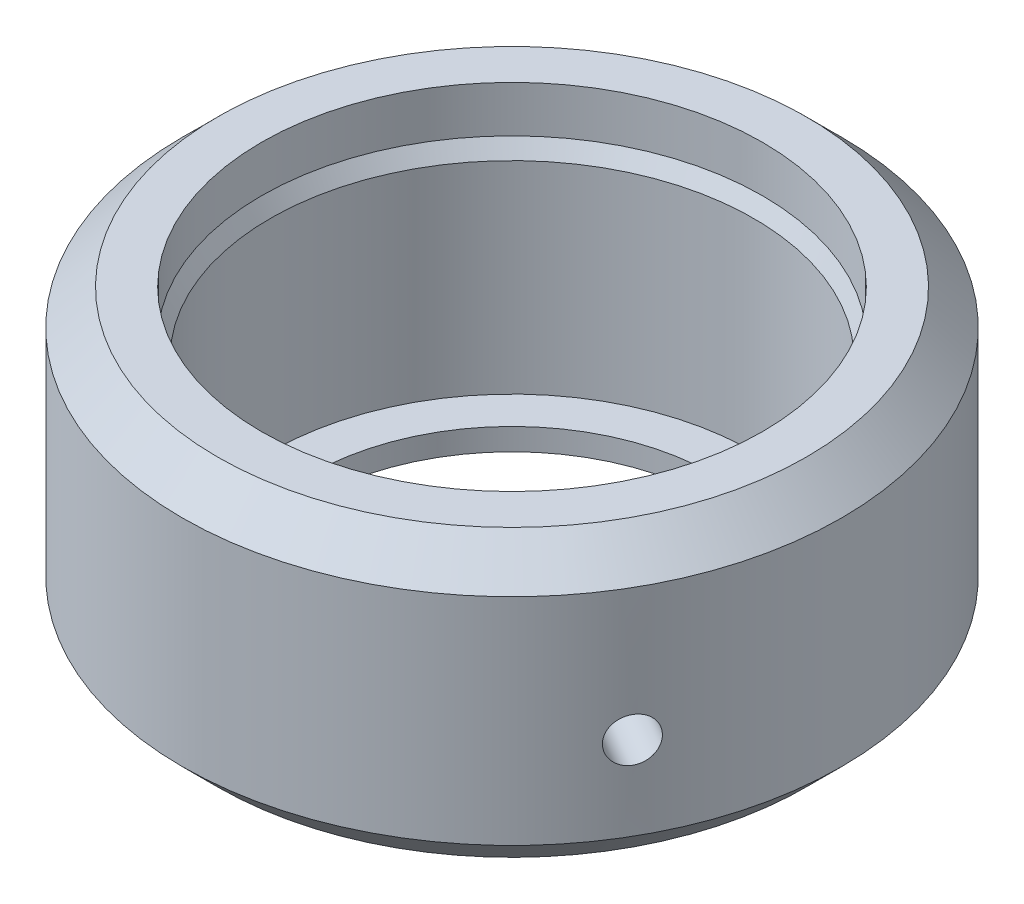
ISO-10303-21;
HEADER;
FILE_DESCRIPTION(('STEP AP214'),'2;1');
FILE_NAME('part.step','',(''),(''),'','','');
FILE_SCHEMA(('AUTOMOTIVE_DESIGN { 1 0 10303 214 1 1 1 1 }'));
ENDSEC;
DATA;
#1=APPLICATION_CONTEXT('core data for automotive mechanical design processes');
#2=APPLICATION_PROTOCOL_DEFINITION('international standard','automotive_design',2000,#1);
#3=PRODUCT_CONTEXT('',#1,'mechanical');
#4=PRODUCT('Part','Part','',(#3));
#5=PRODUCT_RELATED_PRODUCT_CATEGORY('part','',(#4));
#6=PRODUCT_DEFINITION_FORMATION('','',#4);
#7=PRODUCT_DEFINITION_CONTEXT('part definition',#1,'design');
#8=PRODUCT_DEFINITION('design','',#6,#7);
#9=PRODUCT_DEFINITION_SHAPE('','',#8);
#10=(LENGTH_UNIT() NAMED_UNIT(*) SI_UNIT(.MILLI.,.METRE.));
#11=(NAMED_UNIT(*) PLANE_ANGLE_UNIT() SI_UNIT($,.RADIAN.));
#12=(NAMED_UNIT(*) SI_UNIT($,.STERADIAN.) SOLID_ANGLE_UNIT());
#13=UNCERTAINTY_MEASURE_WITH_UNIT(LENGTH_MEASURE(1.E-05),#10,'distance_accuracy_value','');
#14=(GEOMETRIC_REPRESENTATION_CONTEXT(3) GLOBAL_UNCERTAINTY_ASSIGNED_CONTEXT((#13)) GLOBAL_UNIT_ASSIGNED_CONTEXT((#10,
#11,#12)) REPRESENTATION_CONTEXT('',''));
#15=CARTESIAN_POINT('',(0.,0.,0.));
#16=DIRECTION('',(0.,0.,1.));
#17=DIRECTION('',(1.,0.,0.));
#18=AXIS2_PLACEMENT_3D('',#15,#16,#17);
#19=CARTESIAN_POINT('',(0.,5.,0.));
#20=DIRECTION('',(0.,1.,0.));
#21=DIRECTION('',(0.,0.,1.));
#22=AXIS2_PLACEMENT_3D('',#19,#20,#21);
#23=PLANE('',#22);
#24=CARTESIAN_POINT('',(0.,5.,0.));
#25=DIRECTION('',(0.,1.,0.));
#26=DIRECTION('',(0.,0.,1.));
#27=AXIS2_PLACEMENT_3D('',#24,#25,#26);
#28=CIRCLE('',#27,46.);
#29=CARTESIAN_POINT('',(0.,5.,46.));
#30=VERTEX_POINT('',#29);
#31=EDGE_CURVE('E17',#30,#30,#28,.F.);
#32=ORIENTED_EDGE('',*,*,#31,.T.);
#33=EDGE_LOOP('',(#32));
#34=FACE_BOUND('',#33,.T.);
#35=CARTESIAN_POINT('',(0.,5.,0.));
#36=DIRECTION('',(0.,1.,0.));
#37=DIRECTION('',(0.,0.,1.));
#38=AXIS2_PLACEMENT_3D('',#35,#36,#37);
#39=CIRCLE('',#38,55.);
#40=CARTESIAN_POINT('',(0.,5.,55.));
#41=VERTEX_POINT('',#40);
#42=EDGE_CURVE('E115',#41,#41,#39,.T.);
#43=ORIENTED_EDGE('',*,*,#42,.T.);
#44=EDGE_LOOP('',(#43));
#45=FACE_BOUND('',#44,.T.);
#46=ADVANCED_FACE('F14',(#34,#45),#23,.T.);
#47=CARTESIAN_POINT('',(0.,54.4641016151031,0.));
#48=DIRECTION('',(0.,1.,0.));
#49=DIRECTION('',(0.,0.,1.));
#50=AXIS2_PLACEMENT_3D('',#47,#48,#49);
#51=CONICAL_SURFACE('',#50,56.9999999999946,0.523598775598);
#52=CARTESIAN_POINT('',(0.,51.,0.));
#53=DIRECTION('',(0.,1.,0.));
#54=DIRECTION('',(0.,0.,1.));
#55=AXIS2_PLACEMENT_3D('',#52,#53,#54);
#56=CIRCLE('',#55,55.);
#57=CARTESIAN_POINT('',(0.,51.,55.));
#58=VERTEX_POINT('',#57);
#59=EDGE_CURVE('E30',#58,#58,#56,.F.);
#60=ORIENTED_EDGE('',*,*,#59,.T.);
#61=EDGE_LOOP('',(#60));
#62=FACE_BOUND('',#61,.T.);
#63=CARTESIAN_POINT('',(0.,54.4641016151,0.));
#64=DIRECTION('',(0.,1.,0.));
#65=DIRECTION('',(0.,0.,1.));
#66=AXIS2_PLACEMENT_3D('',#63,#64,#65);
#67=CIRCLE('',#66,57.);
#68=CARTESIAN_POINT('',(0.,54.4641016151,57.));
#69=VERTEX_POINT('',#68);
#70=EDGE_CURVE('E112',#69,#69,#67,.T.);
#71=ORIENTED_EDGE('',*,*,#70,.T.);
#72=EDGE_LOOP('',(#71));
#73=FACE_BOUND('',#72,.T.);
#74=ADVANCED_FACE('F99',(#62,#73),#51,.F.);
#75=CARTESIAN_POINT('',(0.,-14.8,0.));
#76=DIRECTION('',(0.,1.,0.));
#77=DIRECTION('',(0.,0.,1.));
#78=AXIS2_PLACEMENT_3D('',#75,#76,#77);
#79=CYLINDRICAL_SURFACE('',#78,46.);
#80=CARTESIAN_POINT('',(0.,0.,0.));
#81=DIRECTION('',(0.,1.,0.));
#82=DIRECTION('',(0.,0.,1.));
#83=AXIS2_PLACEMENT_3D('',#80,#81,#82);
#84=CIRCLE('',#83,46.);
#85=CARTESIAN_POINT('',(0.,0.,46.));
#86=VERTEX_POINT('',#85);
#87=EDGE_CURVE('E83',#86,#86,#84,.F.);
#88=ORIENTED_EDGE('',*,*,#87,.T.);
#89=EDGE_LOOP('',(#88));
#90=FACE_BOUND('',#89,.T.);
#91=ORIENTED_EDGE('',*,*,#31,.F.);
#92=EDGE_LOOP('',(#91));
#93=FACE_BOUND('',#92,.T.);
#94=ADVANCED_FACE('F96',(#90,#93),#79,.F.);
#95=CARTESIAN_POINT('',(0.,0.226794919243,0.));
#96=DIRECTION('',(0.,1.,0.));
#97=DIRECTION('',(0.,0.,1.));
#98=AXIS2_PLACEMENT_3D('',#95,#96,#97);
#99=CYLINDRICAL_SURFACE('',#98,55.);
#100=ORIENTED_EDGE('',*,*,#42,.F.);
#101=EDGE_LOOP('',(#100));
#102=FACE_BOUND('',#101,.T.);
#103=CARTESIAN_POINT('',(49.9341649025134,27.,23.0560008563493));
#104=CARTESIAN_POINT('',(49.9341646831106,27.1400524558636,23.0560016059474));
#105=CARTESIAN_POINT('',(49.9316866792325,27.2801286113787,23.0613704849242));
#106=CARTESIAN_POINT('',(49.9217798817729,27.5593390878845,23.0828080834393));
#107=CARTESIAN_POINT('',(49.9143486889913,27.6984729194302,23.0988819882195));
#108=CARTESIAN_POINT('',(49.8945413156316,27.9749887511215,23.1416356996972));
#109=CARTESIAN_POINT('',(49.882156846797,28.1123674147543,23.1683332824835));
#110=CARTESIAN_POINT('',(49.8524789423696,28.3842029225961,23.2321238704768));
#111=CARTESIAN_POINT('',(49.8351836552412,28.5186586441387,23.2692207965018));
#112=CARTESIAN_POINT('',(49.7957718035326,28.7834637683973,23.3534423018323));
#113=CARTESIAN_POINT('',(49.7736617196794,28.9138184238087,23.400553400024));
#114=CARTESIAN_POINT('',(49.7246754070137,29.1697369217857,23.5044666833726));
#115=CARTESIAN_POINT('',(49.6977974210375,29.2952989772831,23.5612724411078));
#116=CARTESIAN_POINT('',(49.6394022951887,29.5405981238879,23.6840527514007));
#117=CARTESIAN_POINT('',(49.6078889564006,29.6603398817253,23.7500197890687));
#118=CARTESIAN_POINT('',(49.5403131644782,29.8933127354319,23.8906562787399));
#119=CARTESIAN_POINT('',(49.5042490317664,30.0065414049146,23.9653289429809));
#120=CARTESIAN_POINT('',(49.4276305274464,30.2259130669551,24.1229566046696));
#121=CARTESIAN_POINT('',(49.3870655185197,30.3320382806394,24.2059311752824));
#122=CARTESIAN_POINT('',(49.3016697909683,30.536194558105,24.3793909190933));
#123=CARTESIAN_POINT('',(49.2568375011667,30.6342226155754,24.4698788570724));
#124=CARTESIAN_POINT('',(49.1631301420865,30.8214247144555,24.6576080437347));
#125=CARTESIAN_POINT('',(49.1142561889423,30.9106011854255,24.754847426776));
#126=CARTESIAN_POINT('',(49.0126639626494,31.0795321555249,24.955388355847));
#127=CARTESIAN_POINT('',(48.9599442773914,31.1592831652817,25.0586921259046));
#128=CARTESIAN_POINT('',(48.8508635838258,31.3088591290109,25.2706816586983));
#129=CARTESIAN_POINT('',(48.7944977824968,31.3786706147861,25.3793744599359));
#130=CARTESIAN_POINT('',(48.6784652876514,31.5077637936086,25.6012245001598));
#131=CARTESIAN_POINT('',(48.6187973791334,31.5670415765692,25.714383377975));
#132=CARTESIAN_POINT('',(48.4965308244681,31.6745871169516,25.9442366959174));
#133=CARTESIAN_POINT('',(48.4339333516371,31.7228592375171,26.0609297140934));
#134=CARTESIAN_POINT('',(48.3061549500618,31.8080866118851,26.2970239837125));
#135=CARTESIAN_POINT('',(48.2409730665324,31.8450376383845,26.4164262289517));
#136=CARTESIAN_POINT('',(48.0425739195286,31.93824707524,26.7765886198401));
#137=CARTESIAN_POINT('',(47.9060258717888,31.9772811093191,27.0202039873204));
#138=CARTESIAN_POINT('',(47.6278765262335,32.0078811155544,27.5075274216295));
#139=CARTESIAN_POINT('',(47.4862753294983,31.9994480366878,27.7512354865077));
#140=CARTESIAN_POINT('',(47.2735075651719,31.9515812340089,28.111119446485));
#141=CARTESIAN_POINT('',(47.2025912466276,31.9297933115947,28.2300245932263));
#142=CARTESIAN_POINT('',(47.0610783765541,31.8746909347557,28.465306689131));
#143=CARTESIAN_POINT('',(46.990481715374,31.8413807933296,28.581684567003));
#144=CARTESIAN_POINT('',(46.8501289950332,31.7634554823514,28.8111702280211));
#145=CARTESIAN_POINT('',(46.7803732711757,31.7188359500871,28.924276730399));
#146=CARTESIAN_POINT('',(46.642312241264,31.6186382637426,29.1463856702377));
#147=CARTESIAN_POINT('',(46.5740064158544,31.5630641095839,29.2553895884477));
#148=CARTESIAN_POINT('',(46.4392594866758,31.4412301635673,29.468816376505));
#149=CARTESIAN_POINT('',(46.3728220921958,31.3749506659594,29.5732303376763));
#150=CARTESIAN_POINT('',(46.242532545933,31.2322782681088,29.7765471282467));
#151=CARTESIAN_POINT('',(46.1786794599752,31.1558890657348,29.8754519540399));
#152=CARTESIAN_POINT('',(46.0540678437818,30.9934940842437,30.0671900036574));
#153=CARTESIAN_POINT('',(45.99331025933,30.9074853913801,30.1600213742616));
#154=CARTESIAN_POINT('',(45.8754705872491,30.7265090360888,30.338962962367));
#155=CARTESIAN_POINT('',(45.8183871660028,30.6315446555294,30.4250756210063));
#156=CARTESIAN_POINT('',(45.7081782083963,30.4329186829776,30.5903964408339));
#157=CARTESIAN_POINT('',(45.6550685357965,30.3292254137514,30.669577122303));
#158=CARTESIAN_POINT('',(45.5535598771481,30.1142256381617,30.8201464339936));
#159=CARTESIAN_POINT('',(45.5051591688542,30.0029219407717,30.8915379141877));
#160=CARTESIAN_POINT('',(45.4134653975182,29.7733544778492,31.0261793157647));
#161=CARTESIAN_POINT('',(45.3701766452195,29.6550849624487,31.0894223698837));
#162=CARTESIAN_POINT('',(45.2891862816459,29.4125506682875,31.207286320829));
#163=CARTESIAN_POINT('',(45.2514825979048,29.2882881361751,31.2619104164079));
#164=CARTESIAN_POINT('',(45.1819650183459,29.0344330944785,31.3622985786138));
#165=CARTESIAN_POINT('',(45.1501592231563,28.9048335486517,31.4080504633292));
#166=CARTESIAN_POINT('',(45.0928290437925,28.6414347641686,31.4903045918895));
#167=CARTESIAN_POINT('',(45.0673022796643,28.5076371384686,31.5268103404729));
#168=CARTESIAN_POINT('',(45.0228100827017,28.2369853358395,31.5903161351384));
#169=CARTESIAN_POINT('',(45.0038335735914,28.1001367394368,31.6173322293058));
#170=CARTESIAN_POINT('',(44.9725819798215,27.8241921578405,31.6617689349636));
#171=CARTESIAN_POINT('',(44.9603036200017,27.685097305306,31.6791942360528));
#172=CARTESIAN_POINT('',(44.9456840835575,27.4548371097946,31.699930189001));
#173=CARTESIAN_POINT('',(44.9413663255226,27.3640361798798,31.7060501769074));
#174=CARTESIAN_POINT('',(44.9356065593277,27.1821601747837,31.7142127135207));
#175=CARTESIAN_POINT('',(44.9341645516668,27.0910850995548,31.7162552615198));
#176=CARTESIAN_POINT('',(44.9341654419887,26.8599475441367,31.7162543293846));
#177=CARTESIAN_POINT('',(44.9375760256319,26.719871388622,31.7114238755804));
#178=CARTESIAN_POINT('',(44.9511881318111,26.4406609121164,31.6921255380479));
#179=CARTESIAN_POINT('',(44.9613929452984,26.3015270805707,31.6776529839304));
#180=CARTESIAN_POINT('',(44.9885150588647,26.0250112488793,31.6391224396811));
#181=CARTESIAN_POINT('',(45.0054436093598,25.8876325852463,31.6150483836644));
#182=CARTESIAN_POINT('',(45.0458489268706,25.6157970774042,31.5574512705021));
#183=CARTESIAN_POINT('',(45.0693281636465,25.4813413558614,31.5239246494708));
#184=CARTESIAN_POINT('',(45.1225602009535,25.2165362316026,31.4476822320157));
#185=CARTESIAN_POINT('',(45.1523045668611,25.0861815761911,31.4049787886232));
#186=CARTESIAN_POINT('',(45.2178029536989,24.8302630782139,31.3105987557425));
#187=CARTESIAN_POINT('',(45.2535591899907,24.7047010227165,31.258918858217));
#188=CARTESIAN_POINT('',(45.3306924948646,24.4594018761117,31.1469570406283));
#189=CARTESIAN_POINT('',(45.3720649559034,24.3396601182743,31.0866821698458));
#190=CARTESIAN_POINT('',(45.4600718326965,24.1066872645678,30.9578415725246));
#191=CARTESIAN_POINT('',(45.5067081905416,23.9934585950852,30.8892727853103));
#192=CARTESIAN_POINT('',(45.6049084977432,23.7740869330448,30.744105383325));
#193=CARTESIAN_POINT('',(45.6564840792987,23.6679617193606,30.6674877697833));
#194=CARTESIAN_POINT('',(45.7640067601972,23.463805441895,30.5068030284438));
#195=CARTESIAN_POINT('',(45.8199554683224,23.3657773844246,30.4227331575763));
#196=CARTESIAN_POINT('',(45.9356800334637,23.1785752855445,30.2477156107602));
#197=CARTESIAN_POINT('',(45.9954548328538,23.0893988145745,30.1567698342333));
#198=CARTESIAN_POINT('',(46.1183322587814,22.9204678444751,29.9685179209011));
#199=CARTESIAN_POINT('',(46.1814361053291,22.8407168347182,29.8712094491594));
#200=CARTESIAN_POINT('',(46.3104840792822,22.691140870989,29.6707480310723));
#201=CARTESIAN_POINT('',(46.376431905698,22.6213293852139,29.5675874145979));
#202=CARTESIAN_POINT('',(46.5105434289399,22.4922362063913,29.3561753062854));
#203=CARTESIAN_POINT('',(46.5787079375326,22.4329584234307,29.2479219428106));
#204=CARTESIAN_POINT('',(46.7166334726824,22.3254128830483,29.0271093414661));
#205=CARTESIAN_POINT('',(46.7863938544516,22.2771407624829,28.9145518306938));
#206=CARTESIAN_POINT('',(46.926968288842,22.1919133881148,28.6858453540651));
#207=CARTESIAN_POINT('',(46.9977827247235,22.1549623616155,28.5696950644426));
#208=CARTESIAN_POINT('',(47.2104929312188,22.06175292476,28.217795167604));
#209=CARTESIAN_POINT('',(47.3531960043392,22.0227188906809,27.9777334056842));
#210=CARTESIAN_POINT('',(47.636155805533,21.9921188844456,27.4931872892328));
#211=CARTESIAN_POINT('',(47.7764125824571,22.0005519633122,27.2487030232148));
#212=CARTESIAN_POINT('',(47.981697352049,22.0484187659911,26.8844987542131));
#213=CARTESIAN_POINT('',(48.0492140704956,22.0702066884053,26.7636308474403));
#214=CARTESIAN_POINT('',(48.182217907568,22.1253090652443,26.5234360590419));
#215=CARTESIAN_POINT('',(48.2477057756537,22.1586192066704,26.4041086181016));
#216=CARTESIAN_POINT('',(48.3762698277294,22.2365445176487,26.1678167662872));
#217=CARTESIAN_POINT('',(48.4393450701931,22.281164049913,26.0508532861783));
#218=CARTESIAN_POINT('',(48.5626665395453,22.3813617362574,25.8202344570829));
#219=CARTESIAN_POINT('',(48.6229137891225,22.4369358904161,25.7065779179467));
#220=CARTESIAN_POINT('',(48.740373344839,22.5587698364328,25.4831702601675));
#221=CARTESIAN_POINT('',(48.7975797904831,22.6250493340407,25.3734268082009));
#222=CARTESIAN_POINT('',(48.9085125230018,22.7677217318913,25.1589343560046));
#223=CARTESIAN_POINT('',(48.9622400717167,22.8441109342653,25.0541835485586));
#224=CARTESIAN_POINT('',(49.0659842854609,23.0065059157565,24.8503976985197));
#225=CARTESIAN_POINT('',(49.1159998184464,23.09251460862,24.7513644016098));
#226=CARTESIAN_POINT('',(49.2120479434988,23.2734909639113,24.5598414579615));
#227=CARTESIAN_POINT('',(49.2580819828448,23.3684553444707,24.4673494357077));
#228=CARTESIAN_POINT('',(49.3461495337867,23.5670813170225,24.2892452687822));
#229=CARTESIAN_POINT('',(49.3881671791281,23.6707745862487,24.2036606023895));
#230=CARTESIAN_POINT('',(49.4678096987583,23.8857743618383,24.0404668694507));
#231=CARTESIAN_POINT('',(49.5054361800732,23.9970780592282,23.96285488641));
#232=CARTESIAN_POINT('',(49.5761921685721,24.2266455221507,23.8161250502758));
#233=CARTESIAN_POINT('',(49.6093178839028,24.3449150375513,23.7470143640275));
#234=CARTESIAN_POINT('',(49.6708958778251,24.5874493317126,23.6179426762383));
#235=CARTESIAN_POINT('',(49.6993498903847,24.7117118638249,23.5579782805129));
#236=CARTESIAN_POINT('',(49.7515297993149,24.9655669055217,23.4475802095022));
#237=CARTESIAN_POINT('',(49.7752491961546,25.0951664513486,23.3971596405227));
#238=CARTESIAN_POINT('',(49.8178182713722,25.3585652358319,23.30638318451));
#239=CARTESIAN_POINT('',(49.8366697949654,25.492362861532,23.2660234840069));
#240=CARTESIAN_POINT('',(49.8694213279521,25.763014664161,23.1957392138344));
#241=CARTESIAN_POINT('',(49.8833296972571,25.8998632605636,23.165797027786));
#242=CARTESIAN_POINT('',(49.9061872163318,26.1758078421597,23.1165140008438));
#243=CARTESIAN_POINT('',(49.9151387898332,26.3149026946942,23.0971679787787));
#244=CARTESIAN_POINT('',(49.9257868836373,26.5451628902055,23.0741391123519));
#245=CARTESIAN_POINT('',(49.9289280696188,26.6359638201202,23.0673398302528));
#246=CARTESIAN_POINT('',(49.9331171505844,26.8178398252162,23.0582704581025));
#247=CARTESIAN_POINT('',(49.9341650452052,26.9089149004452,23.0560003688376));
#248=CARTESIAN_POINT('',(49.9341649025134,27.,23.0560008563493));
#249=B_SPLINE_CURVE_WITH_KNOTS('',3,(#103,#104,#105,#106,#107,#108,#109,#110,#111,#112,#113,
#114,#115,#116,#117,#118,#119,#120,#121,#122,#123,#124,#125,#126,#127,#128,#129,#130,#131,#132,
#133,#134,#135,#136,#137,#138,#139,#140,#141,#142,#143,#144,#145,#146,#147,#148,#149,#150,#151,
#152,#153,#154,#155,#156,#157,#158,#159,#160,#161,#162,#163,#164,#165,#166,#167,#168,#169,#170,
#171,#172,#173,#174,#175,#176,#177,#178,#179,#180,#181,#182,#183,#184,#185,#186,#187,#188,#189,
#190,#191,#192,#193,#194,#195,#196,#197,#198,#199,#200,#201,#202,#203,#204,#205,#206,#207,#208,
#209,#210,#211,#212,#213,#214,#215,#216,#217,#218,#219,#220,#221,#222,#223,#224,#225,#226,#227,
#228,#229,#230,#231,#232,#233,#234,#235,#236,#237,#238,#239,#240,#241,#242,#243,#244,#245,#246,
#247,#248),.UNSPECIFIED.,.T.,.F.,(4,2,2,2,2,2,2,2,2,2,2,2,2,2,2,2,2,2,2,2,2,2,2,2,2,2,2,2,2,2,2,
2,2,2,2,2,2,2,2,2,2,2,2,2,2,2,2,2,2,2,2,2,2,2,2,2,2,2,2,2,2,2,2,2,2,2,2,2,2,2,2,2,4),(0.,
0.420073891223613,0.840351403678815,1.26133512337001,1.68247777863887,2.10305704063447,
2.52379162624822,2.94418310464884,3.36473019471167,3.78629326902516,4.20801216419457,
4.6296149851037,5.05137340067649,5.47369797415982,5.89617898758607,6.3184922179999,
6.74096294877347,7.58264295393847,8.42430613203715,8.84434369757892,9.26422420443425,
9.68426693162013,10.1041565694487,10.5248281127272,10.945346208309,11.3659920256771,
11.7864842893228,12.2085743769582,12.6305095054295,13.0527979348019,13.4749292698356,
13.8976361673013,14.3201825975521,14.7420109739492,15.1636329057662,15.4368338669647,
15.7100348755908,16.1301087668137,16.5503862792689,16.9713699989605,17.3925126542299,
17.8130919162258,18.2338265018398,18.6542179802402,19.0747650703028,19.4963281446162,
19.9180470397855,20.3396498606947,20.7614082762676,21.183732849751,21.6062138631773,
22.0285270935911,22.4509978243646,23.2926778295296,24.1343410076283,24.55437857317,
24.9742590800253,25.3943018072112,25.8141914450398,26.2348629883183,26.6553810839003,
27.0760269012683,27.4965191649139,27.9186092525492,28.3405443810203,28.7628328103928,
29.1849641454267,29.6076710428926,30.0302174731437,30.4520458495405,30.8736677813573,
31.1468687425556,31.4200697511816),.UNSPECIFIED.);
#250=CARTESIAN_POINT('',(49.9341649025134,27.,23.0560008563493));
#251=VERTEX_POINT('',#250);
#252=EDGE_CURVE('E79',#251,#251,#249,.T.);
#253=ORIENTED_EDGE('',*,*,#252,.T.);
#254=EDGE_LOOP('',(#253));
#255=FACE_BOUND('',#254,.T.);
#256=ORIENTED_EDGE('',*,*,#59,.F.);
#257=EDGE_LOOP('',(#256));
#258=FACE_BOUND('',#257,.T.);
#259=ADVANCED_FACE('F90',(#102,#255,#258),#99,.F.);
#260=CARTESIAN_POINT('',(0.,0.226794919243,0.));
#261=DIRECTION('',(0.,1.,0.));
#262=DIRECTION('',(0.,0.,1.));
#263=AXIS2_PLACEMENT_3D('',#260,#261,#262);
#264=CYLINDRICAL_SURFACE('',#263,57.);
#265=ORIENTED_EDGE('',*,*,#70,.F.);
#266=EDGE_LOOP('',(#265));
#267=FACE_BOUND('',#266,.T.);
#268=CARTESIAN_POINT('',(0.,65.,0.));
#269=DIRECTION('',(0.,1.,0.));
#270=DIRECTION('',(0.,0.,1.));
#271=AXIS2_PLACEMENT_3D('',#268,#269,#270);
#272=CIRCLE('',#271,57.);
#273=CARTESIAN_POINT('',(0.,65.,57.));
#274=VERTEX_POINT('',#273);
#275=EDGE_CURVE('E75',#274,#274,#272,.F.);
#276=ORIENTED_EDGE('',*,*,#275,.F.);
#277=EDGE_LOOP('',(#276));
#278=FACE_BOUND('',#277,.T.);
#279=ADVANCED_FACE('F95',(#267,#278),#264,.F.);
#280=CARTESIAN_POINT('',(0.,0.,0.));
#281=DIRECTION('',(0.,1.,0.));
#282=DIRECTION('',(0.,0.,1.));
#283=AXIS2_PLACEMENT_3D('',#280,#281,#282);
#284=PLANE('',#283);
#285=ORIENTED_EDGE('',*,*,#87,.F.);
#286=EDGE_LOOP('',(#285));
#287=FACE_BOUND('',#286,.T.);
#288=CARTESIAN_POINT('',(0.,0.,0.));
#289=DIRECTION('',(0.,1.,0.));
#290=DIRECTION('',(0.,0.,1.));
#291=AXIS2_PLACEMENT_3D('',#288,#289,#290);
#292=CIRCLE('',#291,66.9999862654897);
#293=CARTESIAN_POINT('',(0.,0.,66.9999862654897));
#294=VERTEX_POINT('',#293);
#295=EDGE_CURVE('E45',#294,#294,#292,.T.);
#296=ORIENTED_EDGE('',*,*,#295,.F.);
#297=EDGE_LOOP('',(#296));
#298=FACE_BOUND('',#297,.T.);
#299=ADVANCED_FACE('F70',(#287,#298),#284,.F.);
#300=CARTESIAN_POINT('',(64.9519052838,27.,37.5));
#301=DIRECTION('',(-0.866025403784329,0.,-0.50000000000019));
#302=DIRECTION('',(-0.50000000000019,0.,0.866025403784329));
#303=AXIS2_PLACEMENT_3D('',#300,#301,#302);
#304=CYLINDRICAL_SURFACE('',#303,5.);
#305=CARTESIAN_POINT('',(62.3074069840694,27.,41.7467008866753));
#306=CARTESIAN_POINT('',(62.3074074861104,27.1401994469576,41.7467002911984));
#307=CARTESIAN_POINT('',(62.3106999599183,27.2804233951994,41.7417873824169));
#308=CARTESIAN_POINT('',(62.3238432818683,27.5599302769909,41.72216070842));
#309=CARTESIAN_POINT('',(62.333697333337,27.6992127173359,41.7074421561409));
#310=CARTESIAN_POINT('',(62.359896051621,27.976028719541,41.6682603521341));
#311=CARTESIAN_POINT('',(62.3762516889803,28.1135589178319,41.6437806295385));
#312=CARTESIAN_POINT('',(62.415307418382,28.3856967596066,41.5852213803083));
#313=CARTESIAN_POINT('',(62.4380099004094,28.5203032815251,41.5511382373458));
#314=CARTESIAN_POINT('',(62.4895120149786,28.7854143956203,41.473642810776));
#315=CARTESIAN_POINT('',(62.5183038236183,28.9159240069547,41.430242497315));
#316=CARTESIAN_POINT('',(62.5817482069081,29.1721440348353,41.3343452317404));
#317=CARTESIAN_POINT('',(62.6164029415956,29.2978526615891,41.2818449268043));
#318=CARTESIAN_POINT('',(62.6912183925425,29.5434290589723,41.1681401283053));
#319=CARTESIAN_POINT('',(62.7313745261004,29.6633015796369,41.1069428777884));
#320=CARTESIAN_POINT('',(62.8168688814516,29.8965153291552,40.9761770512115));
#321=CARTESIAN_POINT('',(62.8622090131757,30.0098541275191,40.9066053892814));
#322=CARTESIAN_POINT('',(62.9577143990435,30.2292873172563,40.7594638962406));
#323=CARTESIAN_POINT('',(63.0078854598257,30.3353727217421,40.6818844317145));
#324=CARTESIAN_POINT('',(63.1125847140798,30.5394359359606,40.5192670571247));
#325=CARTESIAN_POINT('',(63.167114510573,30.6374107356225,40.4342264019105));
#326=CARTESIAN_POINT('',(63.2800271290261,30.8244897774911,40.2572872241693));
#327=CARTESIAN_POINT('',(63.3384088724225,30.9135964854236,40.1653906204061));
#328=CARTESIAN_POINT('',(63.4585638009289,31.0823704039535,39.9752839517123));
#329=CARTESIAN_POINT('',(63.5203382300083,31.1620341178896,39.8770715687377));
#330=CARTESIAN_POINT('',(63.6467750060881,31.3113573319504,39.6749573884008));
#331=CARTESIAN_POINT('',(63.7114388662404,31.3810115077936,39.5710526034191));
#332=CARTESIAN_POINT('',(63.8431138234919,31.5097919133778,39.3582581000635));
#333=CARTESIAN_POINT('',(63.9101257801333,31.5689142386251,39.2493665516661));
#334=CARTESIAN_POINT('',(64.045911258607,31.6761551761755,39.0274025779541));
#335=CARTESIAN_POINT('',(64.1146840826765,31.7242780743165,38.9143318010608));
#336=CARTESIAN_POINT('',(64.2534751677001,31.8092171999472,38.6847383654824));
#337=CARTESIAN_POINT('',(64.3234938843054,31.8460291969741,38.5682144330828));
#338=CARTESIAN_POINT('',(64.534326996492,31.9389240389082,38.2151191460154));
#339=CARTESIAN_POINT('',(64.6762730720848,31.9777446610178,37.9744454728639));
#340=CARTESIAN_POINT('',(64.9586925587562,32.0078785442037,37.4892920829422));
#341=CARTESIAN_POINT('',(65.0991659856969,31.9991923175098,37.2448124072375));
#342=CARTESIAN_POINT('',(65.3055882374112,31.9508965648093,36.880886161425));
#343=CARTESIAN_POINT('',(65.3736638473385,31.9289305459991,36.7600740355212));
#344=CARTESIAN_POINT('',(65.5080050761982,31.8734301566731,36.5201329772484));
#345=CARTESIAN_POINT('',(65.5742713625434,31.8399001157823,36.4010034322654));
#346=CARTESIAN_POINT('',(65.704592111578,31.7614928874273,36.1652421986604));
#347=CARTESIAN_POINT('',(65.7686457135702,31.7166113396702,36.0486114885962));
#348=CARTESIAN_POINT('',(65.8940961689231,31.6158478634393,35.8187830654639));
#349=CARTESIAN_POINT('',(65.9554939878311,31.5599699745472,35.705584109288));
#350=CARTESIAN_POINT('',(66.0753574380403,31.4375278369065,35.4832792879561));
#351=CARTESIAN_POINT('',(66.1338194615707,31.3709508424793,35.3741784985543));
#352=CARTESIAN_POINT('',(66.2473706910375,31.2276587584922,35.1610644214211));
#353=CARTESIAN_POINT('',(66.3024611261532,31.1509473962229,35.0570492824301));
#354=CARTESIAN_POINT('',(66.4089985915394,30.9878873826605,34.8548127988402));
#355=CARTESIAN_POINT('',(66.4604445452444,30.9015359029581,34.7565931676313));
#356=CARTESIAN_POINT('',(66.5593780148241,30.7198582192044,34.5667564779846));
#357=CARTESIAN_POINT('',(66.60686697635,30.6245353201244,34.4751370099088));
#358=CARTESIAN_POINT('',(66.6977554627325,30.4253486104688,34.2989688470936));
#359=CARTESIAN_POINT('',(66.7411460838704,30.3214670823713,34.2144355901167));
#360=CARTESIAN_POINT('',(66.8234873741324,30.1061140258595,34.0533363760883));
#361=CARTESIAN_POINT('',(66.8624396710157,29.9946453041692,33.9767674989969));
#362=CARTESIAN_POINT('',(66.9357611767427,29.7647750296687,33.8320921722314));
#363=CARTESIAN_POINT('',(66.9701265084103,29.6463677320817,33.7639928848336));
#364=CARTESIAN_POINT('',(67.0340579697725,29.4035895002707,33.6368865036269));
#365=CARTESIAN_POINT('',(67.0636258735214,29.2792207926738,33.5778760492444));
#366=CARTESIAN_POINT('',(67.1178732325256,29.0251994447716,33.4693110480961));
#367=CARTESIAN_POINT('',(67.1425464159366,28.8955402786289,33.4197686361355));
#368=CARTESIAN_POINT('',(67.1868345983051,28.6320588432693,33.3306425710748));
#369=CARTESIAN_POINT('',(67.2064515063952,28.4982381667934,33.2910551593346));
#370=CARTESIAN_POINT('',(67.2405207487787,28.2275767956956,33.2221890211941));
#371=CARTESIAN_POINT('',(67.2549818232519,28.0907416335025,33.1928928503146));
#372=CARTESIAN_POINT('',(67.2787156723388,27.8148567991697,33.1447603955084));
#373=CARTESIAN_POINT('',(67.2879909905833,27.6758082471892,33.1259189835216));
#374=CARTESIAN_POINT('',(67.2989043125692,27.4471276494529,33.1037394138415));
#375=CARTESIAN_POINT('',(67.3020921105015,27.3578597473958,33.0972569988191));
#376=CARTESIAN_POINT('',(67.3063435308545,27.179064561302,33.0886104822334));
#377=CARTESIAN_POINT('',(67.3074071531056,27.0895372772445,33.0864463810147));
#378=CARTESIAN_POINT('',(67.3074067193937,26.8598005530424,33.0864475813507));
#379=CARTESIAN_POINT('',(67.3047982524864,26.7195766048006,33.0917554017003));
#380=CARTESIAN_POINT('',(67.2943727151883,26.4400697230091,33.1129511893975));
#381=CARTESIAN_POINT('',(67.286553100742,26.3007872826641,33.1288443244393));
#382=CARTESIAN_POINT('',(67.265720022248,26.023971280459,33.1711239820232));
#383=CARTESIAN_POINT('',(67.2526977792822,25.8864410821681,33.1975282407692));
#384=CARTESIAN_POINT('',(67.2215118465232,25.6143032403934,33.2606311192095));
#385=CARTESIAN_POINT('',(67.2033462198905,25.4796967184749,33.2973336168555));
#386=CARTESIAN_POINT('',(67.1619842690885,25.2145856043797,33.3806834697058));
#387=CARTESIAN_POINT('',(67.1387943994189,25.0840759930453,33.4273180641392));
#388=CARTESIAN_POINT('',(67.0874671229227,24.8278559651647,33.5302111445829));
#389=CARTESIAN_POINT('',(67.0593278924854,24.7021473384109,33.5864731776517));
#390=CARTESIAN_POINT('',(66.9982643739265,24.4565709410277,33.7081176580168));
#391=CARTESIAN_POINT('',(66.965344067116,24.3366984203631,33.7734925150541));
#392=CARTESIAN_POINT('',(66.894844717029,24.1034846708448,33.9129157119569));
#393=CARTESIAN_POINT('',(66.8572639562761,23.9901458724809,33.9869672488058));
#394=CARTESIAN_POINT('',(66.7775883782858,23.7707126827437,34.143248085686));
#395=CARTESIAN_POINT('',(66.7354881215852,23.6646272782579,34.2254872311213));
#396=CARTESIAN_POINT('',(66.6470069712208,23.4605640640394,34.3974681323574));
#397=CARTESIAN_POINT('',(66.6006245016973,23.3625892643775,34.4872126489908));
#398=CARTESIAN_POINT('',(66.5038469880752,23.1755102225089,34.6734674338495));
#399=CARTESIAN_POINT('',(66.4534530663929,23.0864035145764,34.7699758086297));
#400=CARTESIAN_POINT('',(66.3488933261283,22.9176295960466,34.9690863634529));
#401=CARTESIAN_POINT('',(66.2947261220458,22.8379658821104,35.0716907798272));
#402=CARTESIAN_POINT('',(66.1829084954488,22.6886426680496,35.2822453300534));
#403=CARTESIAN_POINT('',(66.1252562421559,22.6189884922064,35.3901982681429));
#404=CARTESIAN_POINT('',(66.00680827509,22.4902080866222,35.6106293778427));
#405=CARTESIAN_POINT('',(65.946011406241,22.4310857613749,35.7231092088501));
#406=CARTESIAN_POINT('',(65.8216777055183,22.3238448238245,35.9516848695293));
#407=CARTESIAN_POINT('',(65.7581419523378,22.2757219256835,36.0677792707101));
#408=CARTESIAN_POINT('',(65.6287037470964,22.1907828000528,36.3027725939484));
#409=CARTESIAN_POINT('',(65.5628004197921,22.1539708030259,36.4216725474688));
#410=CARTESIAN_POINT('',(65.3624274873283,22.0610759610918,36.780807022115));
#411=CARTESIAN_POINT('',(65.2249710101533,22.0222553389822,37.0240727661215));
#412=CARTESIAN_POINT('',(64.9460255930844,21.9921214557963,37.5112319110635));
#413=CARTESIAN_POINT('',(64.8045366966854,22.0008076824902,37.755125305203));
#414=CARTESIAN_POINT('',(64.5925784485649,22.0491034351907,38.1158553420002));
#415=CARTESIAN_POINT('',(64.5219898834106,22.0710694540009,38.2352166125272));
#416=CARTESIAN_POINT('',(64.3813654459652,22.1265698433269,38.4715300586316));
#417=CARTESIAN_POINT('',(64.3113293768411,22.1600998842177,38.5884831185126));
#418=CARTESIAN_POINT('',(64.1723145338289,22.2385071125727,38.8192248146191));
#419=CARTESIAN_POINT('',(64.1033361770479,22.2833886603299,38.9330122161803));
#420=CARTESIAN_POINT('',(63.96702415178,22.3841521365607,39.1565697089984));
#421=CARTESIAN_POINT('',(63.8996898895037,22.4400300254528,39.2663412579976));
#422=CARTESIAN_POINT('',(63.767099991951,22.5624721630935,39.4812984615299));
#423=CARTESIAN_POINT('',(63.7018469485213,22.6290491575207,39.5864784537647));
#424=CARTESIAN_POINT('',(63.5740603585532,22.7723412415078,39.7913737416805));
#425=CARTESIAN_POINT('',(63.5115258233666,22.8490526037771,39.8910910274917));
#426=CARTESIAN_POINT('',(63.3896526236987,23.0121126173395,40.0844734207658));
#427=CARTESIAN_POINT('',(63.3303149047739,23.0984640970419,40.1781367392007));
#428=CARTESIAN_POINT('',(63.2153782437594,23.2801417807956,40.3587339819645));
#429=CARTESIAN_POINT('',(63.1597779376874,23.3754646798756,40.4456703630833));
#430=CARTESIAN_POINT('',(63.0526560765426,23.5746513895312,40.6124661826095));
#431=CARTESIAN_POINT('',(63.0011434391048,23.6785329176287,40.6923101912893));
#432=CARTESIAN_POINT('',(62.9027980723574,23.8938859741405,40.8441694474508));
#433=CARTESIAN_POINT('',(62.8559636280987,24.0053546958308,40.9161875646332));
#434=CARTESIAN_POINT('',(62.7673318726824,24.2352249703313,41.0520235146191));
#435=CARTESIAN_POINT('',(62.72553882565,24.3536322679183,41.1158344085517));
#436=CARTESIAN_POINT('',(62.6474272012229,24.5964104997293,41.2347538687957));
#437=CARTESIAN_POINT('',(62.6111066005133,24.7207792073262,41.2898656517702));
#438=CARTESIAN_POINT('',(62.544210231059,24.9748005552284,41.3911277433301));
#439=CARTESIAN_POINT('',(62.5136418354419,25.1044597213711,41.4372665529366));
#440=CARTESIAN_POINT('',(62.4586004901442,25.3679411567307,41.5201842764854));
#441=CARTESIAN_POINT('',(62.4341252399521,25.5017618332066,41.5569667231053));
#442=CARTESIAN_POINT('',(62.3915200360537,25.7724232043044,41.6209046215673));
#443=CARTESIAN_POINT('',(62.3733793450751,25.9092583664975,41.6480763648669));
#444=CARTESIAN_POINT('',(62.3435623410097,26.1851432008303,41.6926967085088));
#445=CARTESIAN_POINT('',(62.3318828587082,26.3241917528108,41.7101500757301));
#446=CARTESIAN_POINT('',(62.3181314489132,26.5528723505471,41.7306910746497));
#447=CARTESIAN_POINT('',(62.314111411792,26.6421402526042,41.7366929961523));
#448=CARTESIAN_POINT('',(62.3087490189511,26.820935438698,41.744698092473));
#449=CARTESIAN_POINT('',(62.3074066634449,26.9104627227555,41.7467012669719));
#450=CARTESIAN_POINT('',(62.3074069840694,27.,41.7467008866753));
#451=B_SPLINE_CURVE_WITH_KNOTS('',3,(#305,#306,#307,#308,#309,#310,#311,#312,#313,#314,#315,
#316,#317,#318,#319,#320,#321,#322,#323,#324,#325,#326,#327,#328,#329,#330,#331,#332,#333,#334,
#335,#336,#337,#338,#339,#340,#341,#342,#343,#344,#345,#346,#347,#348,#349,#350,#351,#352,#353,
#354,#355,#356,#357,#358,#359,#360,#361,#362,#363,#364,#365,#366,#367,#368,#369,#370,#371,#372,
#373,#374,#375,#376,#377,#378,#379,#380,#381,#382,#383,#384,#385,#386,#387,#388,#389,#390,#391,
#392,#393,#394,#395,#396,#397,#398,#399,#400,#401,#402,#403,#404,#405,#406,#407,#408,#409,#410,
#411,#412,#413,#414,#415,#416,#417,#418,#419,#420,#421,#422,#423,#424,#425,#426,#427,#428,#429,
#430,#431,#432,#433,#434,#435,#436,#437,#438,#439,#440,#441,#442,#443,#444,#445,#446,#447,#448,
#449,#450),.UNSPECIFIED.,.T.,.F.,(4,2,2,2,2,2,2,2,2,2,2,2,2,2,2,2,2,2,2,2,2,2,2,2,2,2,2,2,2,2,2,
2,2,2,2,2,2,2,2,2,2,2,2,2,2,2,2,2,2,2,2,2,2,2,2,2,2,2,2,2,2,2,2,2,2,2,2,2,2,2,2,2,4),(0.,
0.420516327912911,0.841238100281732,1.26267281765867,1.6842664458836,2.10532164293363,
2.52653230560844,2.94739420659717,3.36841166763894,3.78994165134138,4.21162738165705,
4.63319553499385,5.05491930702214,5.47686657888035,5.89896995599352,6.32090858249306,
6.7430048294061,7.58502365274805,8.42703339726791,8.84781930867895,9.26844784656303,
9.68923820054371,10.1098742618853,10.5310151865911,10.952001650037,11.3731119571064,
11.7940677345512,12.2159179668345,12.637612983775,13.059662215213,13.4815550184134,
13.9039849705005,14.3262551883718,14.7478061306443,15.169150118954,15.437709552326,
15.7062690071257,16.1267853350386,16.5475071074074,16.9689418247843,17.3905354530093,
17.8115906500593,18.2328013127341,18.6536632137229,19.0746806747646,19.4962106584671,
19.9178963887827,20.3394645421195,20.7611883141478,21.1831355860061,21.6052389631192,
22.0271775896187,22.4492738365318,23.2912926598737,24.1333024043936,24.5540883158046,
24.9747168536887,25.3955072076694,25.816143269011,26.2372841937168,26.6582706571627,
27.0793809642321,27.5003367416769,27.9221869739602,28.3438819909007,28.7659312223387,
29.1878240255391,29.6102539776262,30.0325241954975,30.45407513777,30.8754191260797,
31.1439785594516,31.4125380142514),.UNSPECIFIED.);
#452=CARTESIAN_POINT('',(62.3074069840694,27.,41.7467008866753));
#453=VERTEX_POINT('',#452);
#454=EDGE_CURVE('E36',#453,#453,#451,.T.);
#455=ORIENTED_EDGE('',*,*,#454,.F.);
#456=EDGE_LOOP('',(#455));
#457=FACE_BOUND('',#456,.T.);
#458=ORIENTED_EDGE('',*,*,#252,.F.);
#459=EDGE_LOOP('',(#458));
#460=FACE_BOUND('',#459,.T.);
#461=ADVANCED_FACE('F47',(#457,#460),#304,.F.);
#462=CARTESIAN_POINT('',(0.,65.,0.));
#463=DIRECTION('',(0.,1.,0.));
#464=DIRECTION('',(0.,0.,1.));
#465=AXIS2_PLACEMENT_3D('',#462,#463,#464);
#466=PLANE('',#465);
#467=ORIENTED_EDGE('',*,*,#275,.T.);
#468=EDGE_LOOP('',(#467));
#469=FACE_BOUND('',#468,.T.);
#470=CARTESIAN_POINT('',(0.,65.,0.));
#471=DIRECTION('',(0.,1.,0.));
#472=DIRECTION('',(0.,0.,1.));
#473=AXIS2_PLACEMENT_3D('',#470,#471,#472);
#474=CIRCLE('',#473,66.9999862654887);
#475=CARTESIAN_POINT('',(0.,65.,66.9999862654887));
#476=VERTEX_POINT('',#475);
#477=EDGE_CURVE('E26',#476,#476,#474,.F.);
#478=ORIENTED_EDGE('',*,*,#477,.F.);
#479=EDGE_LOOP('',(#478));
#480=FACE_BOUND('',#479,.T.);
#481=ADVANCED_FACE('F62',(#469,#480),#466,.T.);
#482=CARTESIAN_POINT('',(0.,8.00000768722666,0.));
#483=DIRECTION('',(0.,1.,0.));
#484=DIRECTION('',(0.,0.,1.));
#485=AXIS2_PLACEMENT_3D('',#482,#483,#484);
#486=CONICAL_SURFACE('',#485,74.9999923127718,0.785398060900999);
#487=CARTESIAN_POINT('',(0.,8.00001537445647,0.));
#488=DIRECTION('',(0.,1.,0.));
#489=DIRECTION('',(0.,0.,1.));
#490=AXIS2_PLACEMENT_3D('',#487,#488,#489);
#491=CIRCLE('',#490,75.);
#492=CARTESIAN_POINT('',(0.,8.00001537445647,75.));
#493=VERTEX_POINT('',#492);
#494=EDGE_CURVE('E21',#493,#493,#491,.T.);
#495=ORIENTED_EDGE('',*,*,#494,.F.);
#496=EDGE_LOOP('',(#495));
#497=FACE_BOUND('',#496,.T.);
#498=ORIENTED_EDGE('',*,*,#295,.T.);
#499=EDGE_LOOP('',(#498));
#500=FACE_BOUND('',#499,.T.);
#501=ADVANCED_FACE('F59',(#497,#500),#486,.T.);
#502=CARTESIAN_POINT('',(0.,56.9999923127728,0.));
#503=DIRECTION('',(0.,-1.,0.));
#504=DIRECTION('',(1.,0.,0.));
#505=AXIS2_PLACEMENT_3D('',#502,#503,#504);
#506=CONICAL_SURFACE('',#505,74.9999923127713,0.785398060901);
#507=CARTESIAN_POINT('',(0.,56.9999846255425,0.));
#508=DIRECTION('',(0.,-1.,0.));
#509=DIRECTION('',(1.,0.,0.));
#510=AXIS2_PLACEMENT_3D('',#507,#508,#509);
#511=CIRCLE('',#510,75.);
#512=CARTESIAN_POINT('',(74.9999999999999,56.9999846255425,0.));
#513=VERTEX_POINT('',#512);
#514=EDGE_CURVE('E10',#513,#513,#511,.T.);
#515=ORIENTED_EDGE('',*,*,#514,.F.);
#516=EDGE_LOOP('',(#515));
#517=FACE_BOUND('',#516,.T.);
#518=ORIENTED_EDGE('',*,*,#477,.T.);
#519=EDGE_LOOP('',(#518));
#520=FACE_BOUND('',#519,.T.);
#521=ADVANCED_FACE('F55',(#517,#520),#506,.T.);
#522=CARTESIAN_POINT('',(0.,0.,0.));
#523=DIRECTION('',(0.,1.,0.));
#524=DIRECTION('',(0.,0.,1.));
#525=AXIS2_PLACEMENT_3D('',#522,#523,#524);
#526=CYLINDRICAL_SURFACE('',#525,75.);
#527=ORIENTED_EDGE('',*,*,#494,.T.);
#528=EDGE_LOOP('',(#527));
#529=FACE_BOUND('',#528,.T.);
#530=ORIENTED_EDGE('',*,*,#514,.T.);
#531=EDGE_LOOP('',(#530));
#532=FACE_BOUND('',#531,.T.);
#533=ORIENTED_EDGE('',*,*,#454,.T.);
#534=EDGE_LOOP('',(#533));
#535=FACE_BOUND('',#534,.T.);
#536=ADVANCED_FACE('F51',(#529,#532,#535),#526,.T.);
#537=CLOSED_SHELL('',(#46,#74,#94,#259,#279,#299,#461,#481,#501,#521,#536));
#538=MANIFOLD_SOLID_BREP('B1',#537);
#539=ADVANCED_BREP_SHAPE_REPRESENTATION('',(#18,#538),#14);
#540=SHAPE_DEFINITION_REPRESENTATION(#9,#539);
ENDSEC;
END-ISO-10303-21;
